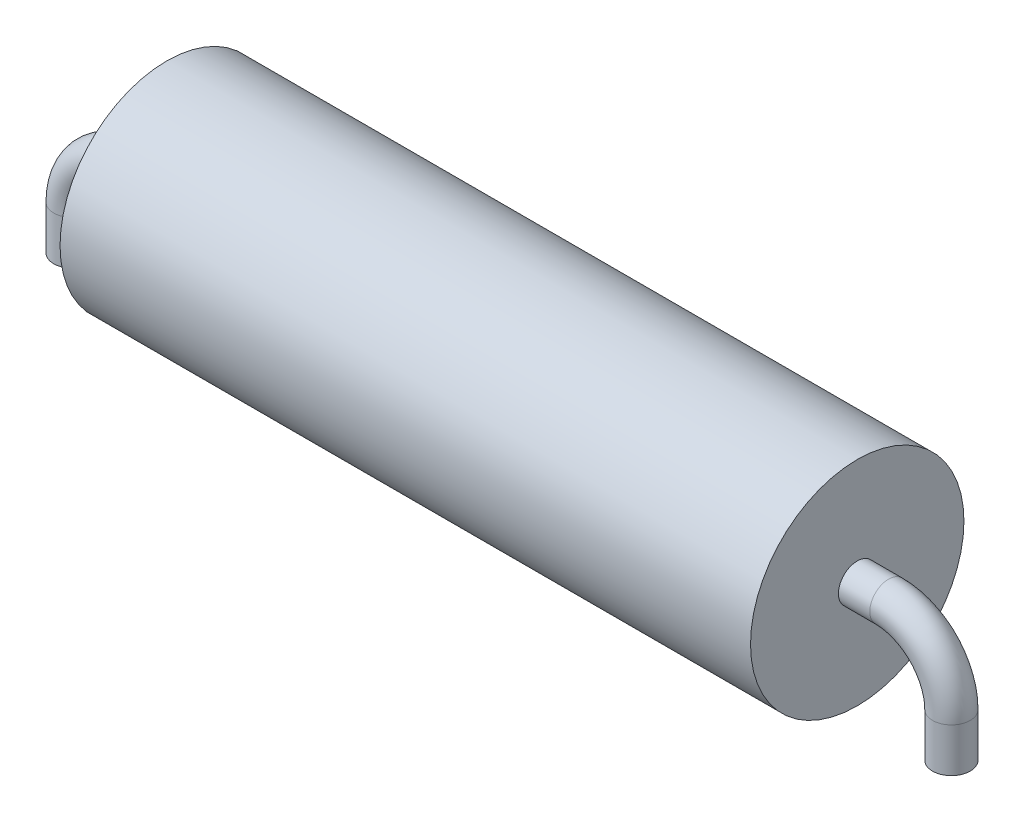
ISO-10303-21;
HEADER;
FILE_DESCRIPTION(('STEP AP214'),'2;1');
FILE_NAME('part.step','',(''),(''),'','','');
FILE_SCHEMA(('AUTOMOTIVE_DESIGN { 1 0 10303 214 1 1 1 1 }'));
ENDSEC;
DATA;
#1=APPLICATION_CONTEXT('core data for automotive mechanical design processes');
#2=APPLICATION_PROTOCOL_DEFINITION('international standard','automotive_design',2000,#1);
#3=PRODUCT_CONTEXT('',#1,'mechanical');
#4=PRODUCT('Part','Part','',(#3));
#5=PRODUCT_RELATED_PRODUCT_CATEGORY('part','',(#4));
#6=PRODUCT_DEFINITION_FORMATION('','',#4);
#7=PRODUCT_DEFINITION_CONTEXT('part definition',#1,'design');
#8=PRODUCT_DEFINITION('design','',#6,#7);
#9=PRODUCT_DEFINITION_SHAPE('','',#8);
#10=(LENGTH_UNIT() NAMED_UNIT(*) SI_UNIT(.MILLI.,.METRE.));
#11=(NAMED_UNIT(*) PLANE_ANGLE_UNIT() SI_UNIT($,.RADIAN.));
#12=(NAMED_UNIT(*) SI_UNIT($,.STERADIAN.) SOLID_ANGLE_UNIT());
#13=UNCERTAINTY_MEASURE_WITH_UNIT(LENGTH_MEASURE(1.E-05),#10,'distance_accuracy_value','');
#14=(GEOMETRIC_REPRESENTATION_CONTEXT(3) GLOBAL_UNCERTAINTY_ASSIGNED_CONTEXT((#13)) GLOBAL_UNIT_ASSIGNED_CONTEXT((#10,
#11,#12)) REPRESENTATION_CONTEXT('',''));
#15=CARTESIAN_POINT('',(0.,0.,0.));
#16=DIRECTION('',(0.,0.,1.));
#17=DIRECTION('',(1.,0.,0.));
#18=AXIS2_PLACEMENT_3D('',#15,#16,#17);
#19=CARTESIAN_POINT('',(-5.5,0.,0.));
#20=DIRECTION('',(1.,0.,0.));
#21=DIRECTION('',(0.,0.,-1.));
#22=AXIS2_PLACEMENT_3D('',#19,#20,#21);
#23=CYLINDRICAL_SURFACE('',#22,1.7);
#24=CARTESIAN_POINT('',(-5.5,0.,0.));
#25=DIRECTION('',(1.,0.,0.));
#26=DIRECTION('',(0.,0.,-1.));
#27=AXIS2_PLACEMENT_3D('',#24,#25,#26);
#28=CIRCLE('',#27,1.7);
#29=CARTESIAN_POINT('',(-5.5,0.,-1.7));
#30=VERTEX_POINT('',#29);
#31=EDGE_CURVE('E11',#30,#30,#28,.T.);
#32=ORIENTED_EDGE('',*,*,#31,.T.);
#33=EDGE_LOOP('',(#32));
#34=FACE_BOUND('',#33,.T.);
#35=CARTESIAN_POINT('',(5.5,0.,0.));
#36=DIRECTION('',(1.,0.,0.));
#37=DIRECTION('',(0.,0.,-1.));
#38=AXIS2_PLACEMENT_3D('',#35,#36,#37);
#39=CIRCLE('',#38,1.7);
#40=CARTESIAN_POINT('',(5.5,0.,-1.7));
#41=VERTEX_POINT('',#40);
#42=EDGE_CURVE('E63',#41,#41,#39,.T.);
#43=ORIENTED_EDGE('',*,*,#42,.F.);
#44=EDGE_LOOP('',(#43));
#45=FACE_BOUND('',#44,.T.);
#46=ADVANCED_FACE('F57',(#34,#45),#23,.T.);
#47=CARTESIAN_POINT('',(-5.5,0.,0.));
#48=DIRECTION('',(1.,0.,0.));
#49=DIRECTION('',(0.,0.,-1.));
#50=AXIS2_PLACEMENT_3D('',#47,#48,#49);
#51=PLANE('',#50);
#52=CARTESIAN_POINT('',(-5.5,0.,0.));
#53=DIRECTION('',(1.,0.,0.));
#54=DIRECTION('',(0.,0.,1.));
#55=AXIS2_PLACEMENT_3D('',#52,#53,#54);
#56=CIRCLE('',#55,0.3);
#57=CARTESIAN_POINT('',(-5.5,0.,0.3));
#58=VERTEX_POINT('',#57);
#59=EDGE_CURVE('E79',#58,#58,#56,.T.);
#60=ORIENTED_EDGE('',*,*,#59,.T.);
#61=EDGE_LOOP('',(#60));
#62=FACE_BOUND('',#61,.T.);
#63=ORIENTED_EDGE('',*,*,#31,.F.);
#64=EDGE_LOOP('',(#63));
#65=FACE_BOUND('',#64,.T.);
#66=ADVANCED_FACE('F114',(#62,#65),#51,.F.);
#67=CARTESIAN_POINT('',(5.5,0.,0.));
#68=DIRECTION('',(1.,0.,0.));
#69=DIRECTION('',(0.,0.,-1.));
#70=AXIS2_PLACEMENT_3D('',#67,#68,#69);
#71=PLANE('',#70);
#72=CARTESIAN_POINT('',(5.5,0.,0.));
#73=DIRECTION('',(1.,0.,0.));
#74=DIRECTION('',(0.,0.,1.));
#75=AXIS2_PLACEMENT_3D('',#72,#73,#74);
#76=CIRCLE('',#75,0.3);
#77=CARTESIAN_POINT('',(5.5,0.,0.3));
#78=VERTEX_POINT('',#77);
#79=EDGE_CURVE('E91',#78,#78,#76,.F.);
#80=ORIENTED_EDGE('',*,*,#79,.T.);
#81=EDGE_LOOP('',(#80));
#82=FACE_BOUND('',#81,.T.);
#83=ORIENTED_EDGE('',*,*,#42,.T.);
#84=EDGE_LOOP('',(#83));
#85=FACE_BOUND('',#84,.T.);
#86=ADVANCED_FACE('F95',(#82,#85),#71,.T.);
#87=CARTESIAN_POINT('',(-7.,-1.7,0.));
#88=DIRECTION('',(0.,1.,0.));
#89=DIRECTION('',(0.,0.,1.));
#90=AXIS2_PLACEMENT_3D('',#87,#88,#89);
#91=PLANE('',#90);
#92=CARTESIAN_POINT('',(-7.,-1.7,0.));
#93=DIRECTION('',(0.,1.,0.));
#94=DIRECTION('',(0.,0.,1.));
#95=AXIS2_PLACEMENT_3D('',#92,#93,#94);
#96=CIRCLE('',#95,0.3);
#97=CARTESIAN_POINT('',(-7.,-1.7,0.3));
#98=VERTEX_POINT('',#97);
#99=EDGE_CURVE('E67',#98,#98,#96,.T.);
#100=ORIENTED_EDGE('',*,*,#99,.F.);
#101=EDGE_LOOP('',(#100));
#102=FACE_BOUND('',#101,.T.);
#103=ADVANCED_FACE('F123',(#102),#91,.F.);
#104=CARTESIAN_POINT('',(-5.5,0.,0.));
#105=DIRECTION('',(-1.,0.,0.));
#106=DIRECTION('',(0.,-1.,0.));
#107=AXIS2_PLACEMENT_3D('',#104,#105,#106);
#108=CYLINDRICAL_SURFACE('',#107,0.3);
#109=CARTESIAN_POINT('',(-5.99999999999999,0.,0.));
#110=DIRECTION('',(1.,0.,0.));
#111=DIRECTION('',(0.,0.,1.));
#112=AXIS2_PLACEMENT_3D('',#109,#110,#111);
#113=CIRCLE('',#112,0.3);
#114=CARTESIAN_POINT('',(-5.99999999999999,0.3,0.));
#115=VERTEX_POINT('',#114);
#116=EDGE_CURVE('E76',#115,#115,#113,.T.);
#117=ORIENTED_EDGE('',*,*,#116,.T.);
#118=EDGE_LOOP('',(#117));
#119=FACE_BOUND('',#118,.T.);
#120=ORIENTED_EDGE('',*,*,#59,.F.);
#121=EDGE_LOOP('',(#120));
#122=FACE_BOUND('',#121,.T.);
#123=ADVANCED_FACE('F129',(#119,#122),#108,.T.);
#124=CARTESIAN_POINT('',(-6.,-1.,0.));
#125=DIRECTION('',(0.,0.,1.));
#126=DIRECTION('',(1.,0.,0.));
#127=AXIS2_PLACEMENT_3D('',#124,#125,#126);
#128=TOROIDAL_SURFACE('',#127,1.,0.3);
#129=CARTESIAN_POINT('',(-7.00000000000001,-0.999999999999961,0.));
#130=DIRECTION('',(0.,1.,0.));
#131=DIRECTION('',(0.,0.,1.));
#132=AXIS2_PLACEMENT_3D('',#129,#130,#131);
#133=CIRCLE('',#132,0.3);
#134=CARTESIAN_POINT('',(-7.3,-0.999999999999949,0.));
#135=VERTEX_POINT('',#134);
#136=EDGE_CURVE('E71',#135,#135,#133,.T.);
#137=CARTESIAN_POINT('',(-6.,-1.,0.));
#138=DIRECTION('',(0.,0.,1.));
#139=DIRECTION('',(1.,0.,0.));
#140=AXIS2_PLACEMENT_3D('',#137,#138,#139);
#141=CIRCLE('',#140,1.3);
#142=EDGE_CURVE('',#115,#135,#141,.T.);
#143=ORIENTED_EDGE('',*,*,#116,.F.);
#144=ORIENTED_EDGE('',*,*,#136,.T.);
#145=ORIENTED_EDGE('',*,*,#142,.T.);
#146=ORIENTED_EDGE('',*,*,#142,.F.);
#147=EDGE_LOOP('',(#143,#145,#144,#146));
#148=FACE_BOUND('',#147,.T.);
#149=ADVANCED_FACE('F133',(#148),#128,.T.);
#150=CARTESIAN_POINT('',(-7.,-1.00000000000001,0.));
#151=DIRECTION('',(0.,-1.,0.));
#152=DIRECTION('',(0.,0.,-1.));
#153=AXIS2_PLACEMENT_3D('',#150,#151,#152);
#154=CYLINDRICAL_SURFACE('',#153,0.3);
#155=ORIENTED_EDGE('',*,*,#99,.T.);
#156=EDGE_LOOP('',(#155));
#157=FACE_BOUND('',#156,.T.);
#158=ORIENTED_EDGE('',*,*,#136,.F.);
#159=EDGE_LOOP('',(#158));
#160=FACE_BOUND('',#159,.T.);
#161=ADVANCED_FACE('F110',(#157,#160),#154,.T.);
#162=CARTESIAN_POINT('',(7.,-1.7,0.));
#163=DIRECTION('',(0.,1.,0.));
#164=DIRECTION('',(0.,0.,1.));
#165=AXIS2_PLACEMENT_3D('',#162,#163,#164);
#166=PLANE('',#165);
#167=CARTESIAN_POINT('',(7.,-1.7,0.));
#168=DIRECTION('',(0.,-1.,0.));
#169=DIRECTION('',(0.,0.,1.));
#170=AXIS2_PLACEMENT_3D('',#167,#168,#169);
#171=CIRCLE('',#170,0.3);
#172=CARTESIAN_POINT('',(7.,-1.7,0.3));
#173=VERTEX_POINT('',#172);
#174=EDGE_CURVE('E82',#173,#173,#171,.F.);
#175=ORIENTED_EDGE('',*,*,#174,.F.);
#176=EDGE_LOOP('',(#175));
#177=FACE_BOUND('',#176,.T.);
#178=ADVANCED_FACE('F100',(#177),#166,.F.);
#179=CARTESIAN_POINT('',(5.5,0.,0.));
#180=DIRECTION('',(1.,0.,0.));
#181=DIRECTION('',(0.,1.,0.));
#182=AXIS2_PLACEMENT_3D('',#179,#180,#181);
#183=CYLINDRICAL_SURFACE('',#182,0.3);
#184=CARTESIAN_POINT('',(5.99999999999999,0.,0.));
#185=DIRECTION('',(1.,0.,0.));
#186=DIRECTION('',(0.,0.,1.));
#187=AXIS2_PLACEMENT_3D('',#184,#185,#186);
#188=CIRCLE('',#187,0.3);
#189=CARTESIAN_POINT('',(5.99999999999999,0.3,0.));
#190=VERTEX_POINT('',#189);
#191=EDGE_CURVE('E88',#190,#190,#188,.F.);
#192=ORIENTED_EDGE('',*,*,#191,.T.);
#193=EDGE_LOOP('',(#192));
#194=FACE_BOUND('',#193,.T.);
#195=ORIENTED_EDGE('',*,*,#79,.F.);
#196=EDGE_LOOP('',(#195));
#197=FACE_BOUND('',#196,.T.);
#198=ADVANCED_FACE('F97',(#194,#197),#183,.T.);
#199=CARTESIAN_POINT('',(6.,-1.,0.));
#200=DIRECTION('',(0.,0.,-1.));
#201=DIRECTION('',(-1.,0.,0.));
#202=AXIS2_PLACEMENT_3D('',#199,#200,#201);
#203=TOROIDAL_SURFACE('',#202,1.,0.3);
#204=CARTESIAN_POINT('',(7.00000000000001,-0.999999999999961,0.));
#205=DIRECTION('',(0.,-1.,0.));
#206=DIRECTION('',(0.,0.,1.));
#207=AXIS2_PLACEMENT_3D('',#204,#205,#206);
#208=CIRCLE('',#207,0.3);
#209=CARTESIAN_POINT('',(7.3,-0.999999999999949,0.));
#210=VERTEX_POINT('',#209);
#211=EDGE_CURVE('E85',#210,#210,#208,.F.);
#212=CARTESIAN_POINT('',(6.,-1.,0.));
#213=DIRECTION('',(0.,0.,-1.));
#214=DIRECTION('',(-1.,0.,0.));
#215=AXIS2_PLACEMENT_3D('',#212,#213,#214);
#216=CIRCLE('',#215,1.3);
#217=EDGE_CURVE('',#190,#210,#216,.T.);
#218=ORIENTED_EDGE('',*,*,#191,.F.);
#219=ORIENTED_EDGE('',*,*,#211,.T.);
#220=ORIENTED_EDGE('',*,*,#217,.T.);
#221=ORIENTED_EDGE('',*,*,#217,.F.);
#222=EDGE_LOOP('',(#218,#220,#219,#221));
#223=FACE_BOUND('',#222,.T.);
#224=ADVANCED_FACE('F99',(#223),#203,.T.);
#225=CARTESIAN_POINT('',(7.,-1.00000000000001,0.));
#226=DIRECTION('',(0.,-1.,0.));
#227=DIRECTION('',(0.,0.,-1.));
#228=AXIS2_PLACEMENT_3D('',#225,#226,#227);
#229=CYLINDRICAL_SURFACE('',#228,0.3);
#230=ORIENTED_EDGE('',*,*,#174,.T.);
#231=EDGE_LOOP('',(#230));
#232=FACE_BOUND('',#231,.T.);
#233=ORIENTED_EDGE('',*,*,#211,.F.);
#234=EDGE_LOOP('',(#233));
#235=FACE_BOUND('',#234,.T.);
#236=ADVANCED_FACE('F107',(#232,#235),#229,.T.);
#237=CLOSED_SHELL('',(#46,#66,#86,#103,#123,#149,#161,#178,#198,#224,#236));
#238=MANIFOLD_SOLID_BREP('B2',#237);
#239=ADVANCED_BREP_SHAPE_REPRESENTATION('',(#18,#238),#14);
#240=SHAPE_DEFINITION_REPRESENTATION(#9,#239);
ENDSEC;
END-ISO-10303-21;
